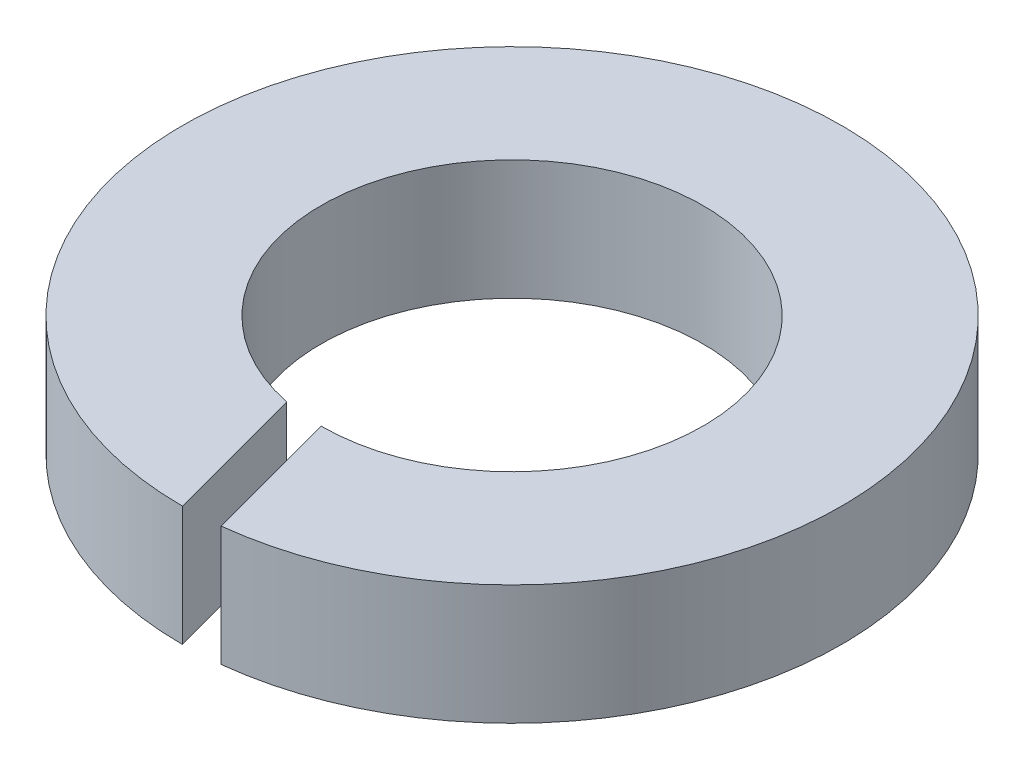
ISO-10303-21;
HEADER;
FILE_DESCRIPTION(('STEP AP214'),'2;1');
FILE_NAME('part.step','',(''),(''),'','','');
FILE_SCHEMA(('AUTOMOTIVE_DESIGN { 1 0 10303 214 1 1 1 1 }'));
ENDSEC;
DATA;
#1=APPLICATION_CONTEXT('core data for automotive mechanical design processes');
#2=APPLICATION_PROTOCOL_DEFINITION('international standard','automotive_design',2000,#1);
#3=PRODUCT_CONTEXT('',#1,'mechanical');
#4=PRODUCT('Part','Part','',(#3));
#5=PRODUCT_RELATED_PRODUCT_CATEGORY('part','',(#4));
#6=PRODUCT_DEFINITION_FORMATION('','',#4);
#7=PRODUCT_DEFINITION_CONTEXT('part definition',#1,'design');
#8=PRODUCT_DEFINITION('design','',#6,#7);
#9=PRODUCT_DEFINITION_SHAPE('','',#8);
#10=(LENGTH_UNIT() NAMED_UNIT(*) SI_UNIT(.MILLI.,.METRE.));
#11=(NAMED_UNIT(*) PLANE_ANGLE_UNIT() SI_UNIT($,.RADIAN.));
#12=(NAMED_UNIT(*) SI_UNIT($,.STERADIAN.) SOLID_ANGLE_UNIT());
#13=UNCERTAINTY_MEASURE_WITH_UNIT(LENGTH_MEASURE(1.E-05),#10,'distance_accuracy_value','');
#14=(GEOMETRIC_REPRESENTATION_CONTEXT(3) GLOBAL_UNCERTAINTY_ASSIGNED_CONTEXT((#13)) GLOBAL_UNIT_ASSIGNED_CONTEXT((#10,
#11,#12)) REPRESENTATION_CONTEXT('',''));
#15=CARTESIAN_POINT('',(0.,0.,0.));
#16=DIRECTION('',(0.,0.,1.));
#17=DIRECTION('',(1.,0.,0.));
#18=AXIS2_PLACEMENT_3D('',#15,#16,#17);
#19=CARTESIAN_POINT('',(0.,1.6,0.));
#20=DIRECTION('',(0.,1.,0.));
#21=DIRECTION('',(0.,0.,1.));
#22=AXIS2_PLACEMENT_3D('',#19,#20,#21);
#23=PLANE('',#22);
#24=DIRECTION('',(0.258819045102522,0.,0.965925826289068));
#25=VECTOR('',#24,1.);
#26=CARTESIAN_POINT('',(0.,1.6,4.4));
#27=LINE('',#26,#25);
#28=CARTESIAN_POINT('',(-0.509482587403887,1.6,2.49858509823705));
#29=VERTEX_POINT('',#28);
#30=CARTESIAN_POINT('',(0.,1.6,4.4));
#31=VERTEX_POINT('',#30);
#32=EDGE_CURVE('E39',#29,#31,#27,.T.);
#33=ORIENTED_EDGE('',*,*,#32,.F.);
#34=CARTESIAN_POINT('',(0.,1.6,0.));
#35=DIRECTION('',(0.,1.,0.));
#36=DIRECTION('',(0.,0.,1.));
#37=AXIS2_PLACEMENT_3D('',#34,#35,#36);
#38=CIRCLE('',#37,2.55);
#39=CARTESIAN_POINT('',(0.,1.6,2.55));
#40=VERTEX_POINT('',#39);
#41=EDGE_CURVE('E83',#40,#29,#38,.T.);
#42=ORIENTED_EDGE('',*,*,#41,.F.);
#43=DIRECTION('',(-0.258819045102522,0.,-0.965925826289068));
#44=VECTOR('',#43,1.);
#45=CARTESIAN_POINT('',(0.,1.6,2.55));
#46=LINE('',#45,#44);
#47=CARTESIAN_POINT('',(0.488419817491812,1.6,4.37280757430295));
#48=VERTEX_POINT('',#47);
#49=EDGE_CURVE('E75',#48,#40,#46,.T.);
#50=ORIENTED_EDGE('',*,*,#49,.F.);
#51=CARTESIAN_POINT('',(0.,1.6,0.));
#52=DIRECTION('',(0.,1.,0.));
#53=DIRECTION('',(0.,0.,1.));
#54=AXIS2_PLACEMENT_3D('',#51,#52,#53);
#55=CIRCLE('',#54,4.4);
#56=EDGE_CURVE('E11',#48,#31,#55,.T.);
#57=ORIENTED_EDGE('',*,*,#56,.T.);
#58=EDGE_LOOP('',(#33,#42,#50,#57));
#59=FACE_BOUND('',#58,.T.);
#60=ADVANCED_FACE('F35',(#59),#23,.T.);
#61=CARTESIAN_POINT('',(0.,0.,0.));
#62=DIRECTION('',(0.,1.,0.));
#63=DIRECTION('',(0.,0.,1.));
#64=AXIS2_PLACEMENT_3D('',#61,#62,#63);
#65=PLANE('',#64);
#66=CARTESIAN_POINT('',(0.,0.,0.));
#67=DIRECTION('',(0.,1.,0.));
#68=DIRECTION('',(0.,0.,1.));
#69=AXIS2_PLACEMENT_3D('',#66,#67,#68);
#70=CIRCLE('',#69,2.55);
#71=CARTESIAN_POINT('',(0.,0.,2.55));
#72=VERTEX_POINT('',#71);
#73=CARTESIAN_POINT('',(-0.509482587403887,0.,2.49858509823705));
#74=VERTEX_POINT('',#73);
#75=EDGE_CURVE('E74',#72,#74,#70,.T.);
#76=ORIENTED_EDGE('',*,*,#75,.T.);
#77=DIRECTION('',(0.258819045102522,0.,0.965925826289068));
#78=VECTOR('',#77,1.);
#79=CARTESIAN_POINT('',(0.,0.,4.4));
#80=LINE('',#79,#78);
#81=CARTESIAN_POINT('',(0.,0.,4.4));
#82=VERTEX_POINT('',#81);
#83=EDGE_CURVE('E54',#74,#82,#80,.T.);
#84=ORIENTED_EDGE('',*,*,#83,.T.);
#85=CARTESIAN_POINT('',(0.,0.,0.));
#86=DIRECTION('',(0.,1.,0.));
#87=DIRECTION('',(0.,0.,1.));
#88=AXIS2_PLACEMENT_3D('',#85,#86,#87);
#89=CIRCLE('',#88,4.4);
#90=CARTESIAN_POINT('',(0.488419817491812,0.,4.37280757430295));
#91=VERTEX_POINT('',#90);
#92=EDGE_CURVE('E45',#91,#82,#89,.T.);
#93=ORIENTED_EDGE('',*,*,#92,.F.);
#94=DIRECTION('',(-0.258819045102522,0.,-0.965925826289068));
#95=VECTOR('',#94,1.);
#96=CARTESIAN_POINT('',(0.,0.,2.55));
#97=LINE('',#96,#95);
#98=EDGE_CURVE('E98',#91,#72,#97,.T.);
#99=ORIENTED_EDGE('',*,*,#98,.T.);
#100=EDGE_LOOP('',(#76,#84,#93,#99));
#101=FACE_BOUND('',#100,.T.);
#102=ADVANCED_FACE('F104',(#101),#65,.F.);
#103=CARTESIAN_POINT('',(0.,1.6,0.));
#104=DIRECTION('',(0.,-1.,0.));
#105=DIRECTION('',(0.,0.,-1.));
#106=AXIS2_PLACEMENT_3D('',#103,#104,#105);
#107=CYLINDRICAL_SURFACE('',#106,4.4);
#108=ORIENTED_EDGE('',*,*,#92,.T.);
#109=DIRECTION('',(0.,1.,0.));
#110=VECTOR('',#109,1.);
#111=CARTESIAN_POINT('',(0.,0.,4.4));
#112=LINE('',#111,#110);
#113=EDGE_CURVE('E70',#82,#31,#112,.T.);
#114=ORIENTED_EDGE('',*,*,#113,.T.);
#115=ORIENTED_EDGE('',*,*,#56,.F.);
#116=DIRECTION('',(0.,1.,0.));
#117=VECTOR('',#116,1.);
#118=CARTESIAN_POINT('',(0.488419817491812,0.,4.37280757430295));
#119=LINE('',#118,#117);
#120=EDGE_CURVE('E94',#91,#48,#119,.T.);
#121=ORIENTED_EDGE('',*,*,#120,.F.);
#122=EDGE_LOOP('',(#108,#114,#115,#121));
#123=FACE_BOUND('',#122,.T.);
#124=ADVANCED_FACE('F37',(#123),#107,.T.);
#125=CARTESIAN_POINT('',(0.,1.6,0.));
#126=DIRECTION('',(0.,-1.,0.));
#127=DIRECTION('',(0.,0.,-1.));
#128=AXIS2_PLACEMENT_3D('',#125,#126,#127);
#129=CYLINDRICAL_SURFACE('',#128,2.55);
#130=DIRECTION('',(0.,1.,0.));
#131=VECTOR('',#130,1.);
#132=CARTESIAN_POINT('',(-0.509482587403887,0.,2.49858509823705));
#133=LINE('',#132,#131);
#134=EDGE_CURVE('E66',#74,#29,#133,.T.);
#135=ORIENTED_EDGE('',*,*,#134,.F.);
#136=ORIENTED_EDGE('',*,*,#75,.F.);
#137=DIRECTION('',(0.,1.,0.));
#138=VECTOR('',#137,1.);
#139=CARTESIAN_POINT('',(0.,0.,2.55));
#140=LINE('',#139,#138);
#141=EDGE_CURVE('E92',#72,#40,#140,.T.);
#142=ORIENTED_EDGE('',*,*,#141,.T.);
#143=ORIENTED_EDGE('',*,*,#41,.T.);
#144=EDGE_LOOP('',(#135,#136,#142,#143));
#145=FACE_BOUND('',#144,.T.);
#146=ADVANCED_FACE('F107',(#145),#129,.F.);
#147=CARTESIAN_POINT('',(0.,0.,2.55));
#148=DIRECTION('',(0.965925826289068,0.,-0.258819045102522));
#149=DIRECTION('',(-0.258819045102522,0.,-0.965925826289068));
#150=AXIS2_PLACEMENT_3D('',#147,#148,#149);
#151=PLANE('',#150);
#152=ORIENTED_EDGE('',*,*,#49,.T.);
#153=ORIENTED_EDGE('',*,*,#141,.F.);
#154=ORIENTED_EDGE('',*,*,#98,.F.);
#155=ORIENTED_EDGE('',*,*,#120,.T.);
#156=EDGE_LOOP('',(#152,#153,#154,#155));
#157=FACE_BOUND('',#156,.T.);
#158=ADVANCED_FACE('F108',(#157),#151,.F.);
#159=CARTESIAN_POINT('',(0.,0.,4.4));
#160=DIRECTION('',(-0.965925826289068,0.,0.258819045102522));
#161=DIRECTION('',(0.258819045102522,0.,0.965925826289068));
#162=AXIS2_PLACEMENT_3D('',#159,#160,#161);
#163=PLANE('',#162);
#164=ORIENTED_EDGE('',*,*,#32,.T.);
#165=ORIENTED_EDGE('',*,*,#113,.F.);
#166=ORIENTED_EDGE('',*,*,#83,.F.);
#167=ORIENTED_EDGE('',*,*,#134,.T.);
#168=EDGE_LOOP('',(#164,#165,#166,#167));
#169=FACE_BOUND('',#168,.T.);
#170=ADVANCED_FACE('F69',(#169),#163,.F.);
#171=CLOSED_SHELL('',(#60,#102,#124,#146,#158,#170));
#172=MANIFOLD_SOLID_BREP('B2',#171);
#173=ADVANCED_BREP_SHAPE_REPRESENTATION('',(#18,#172),#14);
#174=SHAPE_DEFINITION_REPRESENTATION(#9,#173);
ENDSEC;
END-ISO-10303-21;
